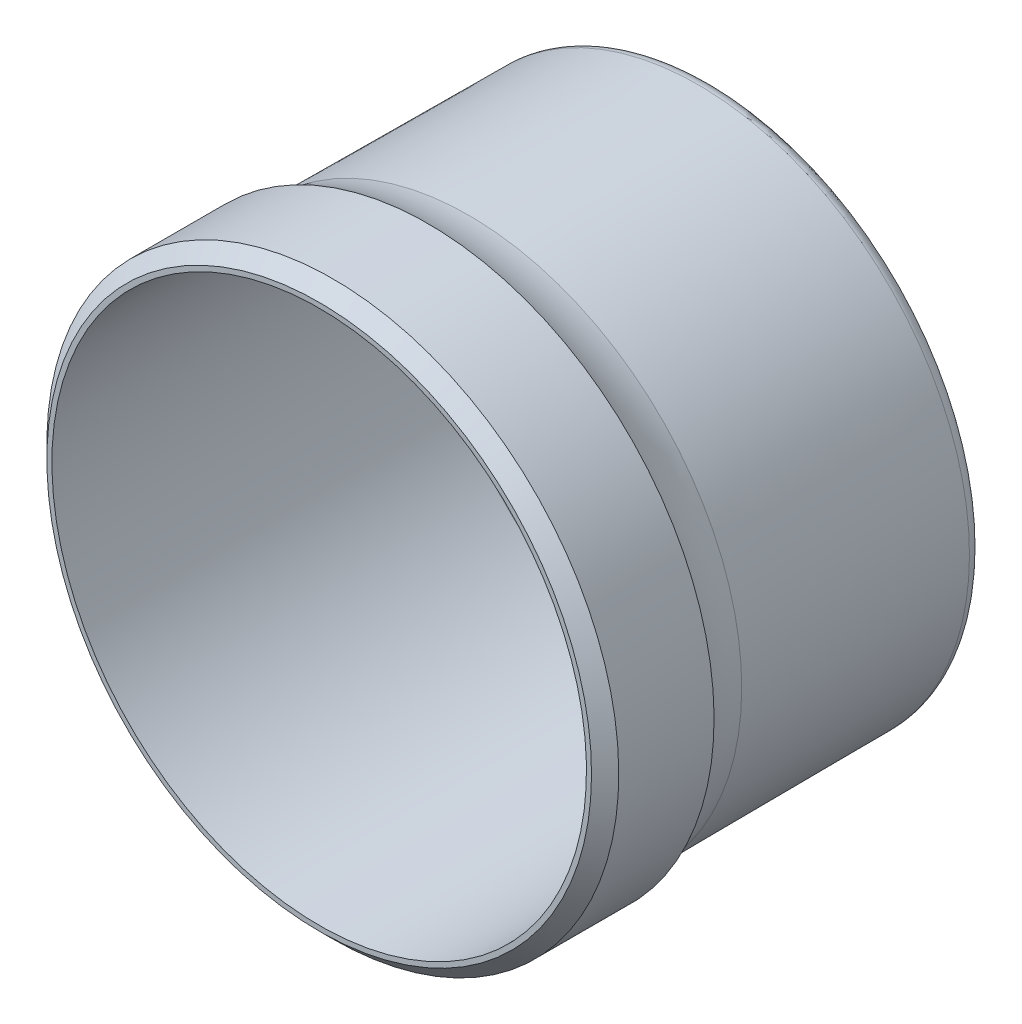
ISO-10303-21;
HEADER;
FILE_DESCRIPTION(('STEP AP214'),'2;1');
FILE_NAME('part.step','',(''),(''),'','','');
FILE_SCHEMA(('AUTOMOTIVE_DESIGN { 1 0 10303 214 1 1 1 1 }'));
ENDSEC;
DATA;
#1=APPLICATION_CONTEXT('core data for automotive mechanical design processes');
#2=APPLICATION_PROTOCOL_DEFINITION('international standard','automotive_design',2000,#1);
#3=PRODUCT_CONTEXT('',#1,'mechanical');
#4=PRODUCT('Part','Part','',(#3));
#5=PRODUCT_RELATED_PRODUCT_CATEGORY('part','',(#4));
#6=PRODUCT_DEFINITION_FORMATION('','',#4);
#7=PRODUCT_DEFINITION_CONTEXT('part definition',#1,'design');
#8=PRODUCT_DEFINITION('design','',#6,#7);
#9=PRODUCT_DEFINITION_SHAPE('','',#8);
#10=(LENGTH_UNIT() NAMED_UNIT(*) SI_UNIT(.MILLI.,.METRE.));
#11=(NAMED_UNIT(*) PLANE_ANGLE_UNIT() SI_UNIT($,.RADIAN.));
#12=(NAMED_UNIT(*) SI_UNIT($,.STERADIAN.) SOLID_ANGLE_UNIT());
#13=UNCERTAINTY_MEASURE_WITH_UNIT(LENGTH_MEASURE(1.E-05),#10,'distance_accuracy_value','');
#14=(GEOMETRIC_REPRESENTATION_CONTEXT(3) GLOBAL_UNCERTAINTY_ASSIGNED_CONTEXT((#13)) GLOBAL_UNIT_ASSIGNED_CONTEXT((#10,
#11,#12)) REPRESENTATION_CONTEXT('',''));
#15=CARTESIAN_POINT('',(0.,0.,0.));
#16=DIRECTION('',(0.,0.,1.));
#17=DIRECTION('',(1.,0.,0.));
#18=AXIS2_PLACEMENT_3D('',#15,#16,#17);
#19=CARTESIAN_POINT('',(0.,0.,6.50000000003789));
#20=DIRECTION('',(0.,0.,-1.));
#21=DIRECTION('',(0.793112373791637,0.609075334042182,0.));
#22=AXIS2_PLACEMENT_3D('',#19,#20,#21);
#23=CYLINDRICAL_SURFACE('',#22,9.815);
#24=CARTESIAN_POINT('',(0.,0.,-7.34999999996211));
#25=DIRECTION('',(0.,0.,-1.));
#26=DIRECTION('',(-0.793112373791637,-0.609075334042182,0.));
#27=AXIS2_PLACEMENT_3D('',#24,#25,#26);
#28=CIRCLE('',#27,9.815);
#29=CARTESIAN_POINT('',(-7.78439794876488,-5.97807440362398,-7.34999999996211));
#30=VERTEX_POINT('',#29);
#31=EDGE_CURVE('E11',#30,#30,#28,.T.);
#32=ORIENTED_EDGE('',*,*,#31,.T.);
#33=EDGE_LOOP('',(#32));
#34=FACE_BOUND('',#33,.T.);
#35=CARTESIAN_POINT('',(0.,0.,6.50000000003789));
#36=DIRECTION('',(0.,0.,-1.));
#37=DIRECTION('',(-0.793112373791637,-0.609075334042182,0.));
#38=AXIS2_PLACEMENT_3D('',#35,#36,#37);
#39=CIRCLE('',#38,9.815);
#40=CARTESIAN_POINT('',(-7.78439794876491,-5.97807440362401,6.50000000003789));
#41=VERTEX_POINT('',#40);
#42=EDGE_CURVE('E148',#41,#41,#39,.T.);
#43=ORIENTED_EDGE('',*,*,#42,.F.);
#44=EDGE_LOOP('',(#43));
#45=FACE_BOUND('',#44,.T.);
#46=ADVANCED_FACE('F17',(#34,#45),#23,.F.);
#47=CARTESIAN_POINT('',(0.,0.,-7.34999999996211));
#48=DIRECTION('',(0.,0.,-1.));
#49=DIRECTION('',(0.793112373791637,0.609075334042182,0.));
#50=AXIS2_PLACEMENT_3D('',#47,#48,#49);
#51=TOROIDAL_SURFACE('',#50,9.415,0.4);
#52=CARTESIAN_POINT('',(0.,0.,-7.74999999996211));
#53=DIRECTION('',(0.,0.,-1.));
#54=DIRECTION('',(-0.793112373791637,-0.609075334042182,0.));
#55=AXIS2_PLACEMENT_3D('',#52,#53,#54);
#56=CIRCLE('',#55,9.415);
#57=CARTESIAN_POINT('',(-7.46715299924822,-5.73444427000711,-7.74999999996211));
#58=VERTEX_POINT('',#57);
#59=EDGE_CURVE('E28',#58,#58,#56,.T.);
#60=ORIENTED_EDGE('',*,*,#59,.T.);
#61=EDGE_LOOP('',(#60));
#62=FACE_BOUND('',#61,.T.);
#63=ORIENTED_EDGE('',*,*,#31,.F.);
#64=EDGE_LOOP('',(#63));
#65=FACE_BOUND('',#64,.T.);
#66=ADVANCED_FACE('F236',(#62,#65),#51,.F.);
#67=CARTESIAN_POINT('',(-3.65250076357213,4.75613341891109,-7.74999999998101));
#68=DIRECTION('',(0.,0.,1.));
#69=DIRECTION('',(-0.793112373791637,-0.609075334042182,0.));
#70=AXIS2_PLACEMENT_3D('',#67,#68,#69);
#71=PLANE('',#70);
#72=CARTESIAN_POINT('',(-1.52927118695299,-3.69612359597936,-7.74999999998101));
#73=DIRECTION('',(0.,0.,-1.));
#74=DIRECTION('',(0.793112373791637,0.609075334042182,0.));
#75=AXIS2_PLACEMENT_3D('',#72,#73,#74);
#76=CIRCLE('',#75,1.75);
#77=CARTESIAN_POINT('',(-0.14132453281763,-2.63024176140554,-7.74999999998101));
#78=VERTEX_POINT('',#77);
#79=EDGE_CURVE('E222',#78,#78,#76,.T.);
#80=ORIENTED_EDGE('',*,*,#79,.T.);
#81=EDGE_LOOP('',(#80));
#82=FACE_BOUND('',#81,.T.);
#83=CARTESIAN_POINT('',(-2.43630133616872,3.17244949516655,-7.74999999998101));
#84=DIRECTION('',(0.,0.,-1.));
#85=DIRECTION('',(0.793112373791637,0.609075334042182,0.));
#86=AXIS2_PLACEMENT_3D('',#83,#84,#85);
#87=CIRCLE('',#86,1.75);
#88=CARTESIAN_POINT('',(-1.04835468203336,4.23833132974037,-7.74999999998101));
#89=VERTEX_POINT('',#88);
#90=EDGE_CURVE('E218',#89,#89,#87,.T.);
#91=ORIENTED_EDGE('',*,*,#90,.T.);
#92=EDGE_LOOP('',(#91));
#93=FACE_BOUND('',#92,.T.);
#94=CARTESIAN_POINT('',(3.96557252312171,0.523674100812805,-7.74999999998101));
#95=DIRECTION('',(0.,0.,-1.));
#96=DIRECTION('',(0.793112373791637,0.609075334042182,0.));
#97=AXIS2_PLACEMENT_3D('',#94,#95,#96);
#98=CIRCLE('',#97,1.75);
#99=CARTESIAN_POINT('',(5.35351917725708,1.58955593538663,-7.74999999998101));
#100=VERTEX_POINT('',#99);
#101=EDGE_CURVE('E214',#100,#100,#98,.T.);
#102=ORIENTED_EDGE('',*,*,#101,.T.);
#103=EDGE_LOOP('',(#102));
#104=FACE_BOUND('',#103,.T.);
#105=CARTESIAN_POINT('',(0.,0.,-7.74999999998101));
#106=DIRECTION('',(0.,0.,-1.));
#107=DIRECTION('',(0.793112373791637,0.609075334042182,0.));
#108=AXIS2_PLACEMENT_3D('',#105,#106,#107);
#109=CIRCLE('',#108,2.1);
#110=CARTESIAN_POINT('',(1.66553598496244,1.27905820148858,-7.74999999998101));
#111=VERTEX_POINT('',#110);
#112=EDGE_CURVE('E210',#111,#111,#109,.T.);
#113=ORIENTED_EDGE('',*,*,#112,.T.);
#114=EDGE_LOOP('',(#113));
#115=FACE_BOUND('',#114,.T.);
#116=ORIENTED_EDGE('',*,*,#59,.F.);
#117=EDGE_LOOP('',(#116));
#118=FACE_BOUND('',#117,.T.);
#119=ADVANCED_FACE('F242',(#82,#93,#104,#115,#118),#71,.T.);
#120=CARTESIAN_POINT('',(0.,0.,6.50000000003789));
#121=DIRECTION('',(0.,0.,-1.));
#122=DIRECTION('',(0.793112373791637,0.609075334042182,0.));
#123=AXIS2_PLACEMENT_3D('',#120,#121,#122);
#124=CYLINDRICAL_SURFACE('',#123,2.);
#125=CARTESIAN_POINT('',(0.,0.,-10.4));
#126=DIRECTION('',(0.,0.,-1.));
#127=DIRECTION('',(-0.793112373791637,-0.609075334042182,0.));
#128=AXIS2_PLACEMENT_3D('',#125,#126,#127);
#129=CIRCLE('',#128,2.);
#130=CARTESIAN_POINT('',(-1.58622474758327,-1.21815066808436,-10.4));
#131=VERTEX_POINT('',#130);
#132=EDGE_CURVE('E206',#131,#131,#129,.T.);
#133=ORIENTED_EDGE('',*,*,#132,.T.);
#134=EDGE_LOOP('',(#133));
#135=FACE_BOUND('',#134,.T.);
#136=CARTESIAN_POINT('',(0.,0.,-7.84999999998101));
#137=DIRECTION('',(0.,0.,1.));
#138=DIRECTION('',(0.793112373791637,0.609075334042182,0.));
#139=AXIS2_PLACEMENT_3D('',#136,#137,#138);
#140=CIRCLE('',#139,2.);
#141=CARTESIAN_POINT('',(1.58622474758327,1.21815066808436,-7.84999999998101));
#142=VERTEX_POINT('',#141);
#143=EDGE_CURVE('E202',#142,#142,#140,.T.);
#144=ORIENTED_EDGE('',*,*,#143,.T.);
#145=EDGE_LOOP('',(#144));
#146=FACE_BOUND('',#145,.T.);
#147=ADVANCED_FACE('F248',(#135,#146),#124,.F.);
#148=CARTESIAN_POINT('',(-2.43630133534537,3.1724494940944,-10.5));
#149=DIRECTION('',(0.,0.,-1.));
#150=DIRECTION('',(0.793112373791637,0.609075334042182,0.));
#151=AXIS2_PLACEMENT_3D('',#148,#149,#150);
#152=PLANE('',#151);
#153=CARTESIAN_POINT('',(-1.52927118695299,-3.69612359597936,-10.5));
#154=DIRECTION('',(0.,0.,1.));
#155=DIRECTION('',(-0.793112373791637,-0.609075334042182,0.));
#156=AXIS2_PLACEMENT_3D('',#153,#154,#155);
#157=CIRCLE('',#156,1.75);
#158=CARTESIAN_POINT('',(-2.91721784108836,-4.76200543055318,-10.5));
#159=VERTEX_POINT('',#158);
#160=EDGE_CURVE('E198',#159,#159,#157,.T.);
#161=ORIENTED_EDGE('',*,*,#160,.T.);
#162=EDGE_LOOP('',(#161));
#163=FACE_BOUND('',#162,.T.);
#164=CARTESIAN_POINT('',(0.,0.,-10.5));
#165=DIRECTION('',(0.,0.,1.));
#166=DIRECTION('',(-0.793112373791637,-0.609075334042182,0.));
#167=AXIS2_PLACEMENT_3D('',#164,#165,#166);
#168=CIRCLE('',#167,2.1);
#169=CARTESIAN_POINT('',(-1.66553598496244,-1.27905820148858,-10.5));
#170=VERTEX_POINT('',#169);
#171=EDGE_CURVE('E194',#170,#170,#168,.T.);
#172=ORIENTED_EDGE('',*,*,#171,.T.);
#173=EDGE_LOOP('',(#172));
#174=FACE_BOUND('',#173,.T.);
#175=CARTESIAN_POINT('',(-2.43630133616872,3.17244949516655,-10.5));
#176=DIRECTION('',(0.,0.,1.));
#177=DIRECTION('',(-0.793112373791637,-0.609075334042182,0.));
#178=AXIS2_PLACEMENT_3D('',#175,#176,#177);
#179=CIRCLE('',#178,1.75);
#180=CARTESIAN_POINT('',(-3.82424799030409,2.10656766059273,-10.5));
#181=VERTEX_POINT('',#180);
#182=EDGE_CURVE('E190',#181,#181,#179,.T.);
#183=ORIENTED_EDGE('',*,*,#182,.T.);
#184=EDGE_LOOP('',(#183));
#185=FACE_BOUND('',#184,.T.);
#186=CARTESIAN_POINT('',(3.96557252312171,0.523674100812805,-10.5));
#187=DIRECTION('',(0.,0.,1.));
#188=DIRECTION('',(-0.793112373791637,-0.609075334042182,0.));
#189=AXIS2_PLACEMENT_3D('',#186,#187,#188);
#190=CIRCLE('',#189,1.75);
#191=CARTESIAN_POINT('',(2.57762586898635,-0.542207733761013,-10.5));
#192=VERTEX_POINT('',#191);
#193=EDGE_CURVE('E186',#192,#192,#190,.T.);
#194=ORIENTED_EDGE('',*,*,#193,.T.);
#195=EDGE_LOOP('',(#194));
#196=FACE_BOUND('',#195,.T.);
#197=CARTESIAN_POINT('',(0.,0.,-10.5));
#198=DIRECTION('',(0.,0.,-1.));
#199=DIRECTION('',(-0.793112373791637,-0.609075334042182,0.));
#200=AXIS2_PLACEMENT_3D('',#197,#198,#199);
#201=CIRCLE('',#200,5.79999999864818);
#202=CARTESIAN_POINT('',(-4.60005176691935,-3.5326369366213,-10.5));
#203=VERTEX_POINT('',#202);
#204=EDGE_CURVE('E182',#203,#203,#201,.T.);
#205=ORIENTED_EDGE('',*,*,#204,.T.);
#206=EDGE_LOOP('',(#205));
#207=FACE_BOUND('',#206,.T.);
#208=ADVANCED_FACE('F252',(#163,#174,#185,#196,#207),#152,.T.);
#209=CARTESIAN_POINT('',(0.,0.,6.50000000003789));
#210=DIRECTION('',(0.,0.,-1.));
#211=DIRECTION('',(0.793112373791637,0.609075334042182,0.));
#212=AXIS2_PLACEMENT_3D('',#209,#210,#211);
#213=CYLINDRICAL_SURFACE('',#212,5.99999999864818);
#214=CARTESIAN_POINT('',(0.,0.,-10.3));
#215=DIRECTION('',(0.,0.,1.));
#216=DIRECTION('',(-0.793112373791637,-0.609075334042182,0.));
#217=AXIS2_PLACEMENT_3D('',#214,#215,#216);
#218=CIRCLE('',#217,5.99999999864818);
#219=CARTESIAN_POINT('',(-4.75867424167768,-3.65445200342973,-10.3));
#220=VERTEX_POINT('',#219);
#221=EDGE_CURVE('E178',#220,#220,#218,.T.);
#222=ORIENTED_EDGE('',*,*,#221,.T.);
#223=EDGE_LOOP('',(#222));
#224=FACE_BOUND('',#223,.T.);
#225=CARTESIAN_POINT('',(0.,0.,-8.2));
#226=DIRECTION('',(0.,0.,-1.));
#227=DIRECTION('',(-0.793112373791637,-0.609075334042182,0.));
#228=AXIS2_PLACEMENT_3D('',#225,#226,#227);
#229=CIRCLE('',#228,5.99999999864818);
#230=CARTESIAN_POINT('',(-4.75867424167768,-3.65445200342973,-8.2));
#231=VERTEX_POINT('',#230);
#232=EDGE_CURVE('E174',#231,#231,#229,.T.);
#233=ORIENTED_EDGE('',*,*,#232,.T.);
#234=EDGE_LOOP('',(#233));
#235=FACE_BOUND('',#234,.T.);
#236=ADVANCED_FACE('F256',(#224,#235),#213,.T.);
#237=CARTESIAN_POINT('',(0.,0.,-8.2));
#238=DIRECTION('',(0.,0.,-1.));
#239=DIRECTION('',(0.793112373791637,0.609075334042182,0.));
#240=AXIS2_PLACEMENT_3D('',#237,#238,#239);
#241=TOROIDAL_SURFACE('',#240,6.19999999864818,0.2);
#242=CARTESIAN_POINT('',(0.,0.,-8.00007848836941));
#243=DIRECTION('',(0.,0.,-1.));
#244=DIRECTION('',(-0.793112373791637,-0.609075334042182,0.));
#245=AXIS2_PLACEMENT_3D('',#242,#243,#244);
#246=CIRCLE('',#245,6.19439739324077);
#247=CARTESIAN_POINT('',(-4.91285322076191,-3.77285466147814,-8.00007848836941));
#248=VERTEX_POINT('',#247);
#249=EDGE_CURVE('E171',#248,#248,#246,.T.);
#250=ORIENTED_EDGE('',*,*,#249,.T.);
#251=EDGE_LOOP('',(#250));
#252=FACE_BOUND('',#251,.T.);
#253=ORIENTED_EDGE('',*,*,#232,.F.);
#254=EDGE_LOOP('',(#253));
#255=FACE_BOUND('',#254,.T.);
#256=ADVANCED_FACE('F260',(#252,#255),#241,.F.);
#257=CARTESIAN_POINT('',(0.,0.,-8.00007848836941));
#258=DIRECTION('',(0.,0.,1.));
#259=DIRECTION('',(-0.793112373791637,-0.609075334042182,0.));
#260=AXIS2_PLACEMENT_3D('',#257,#258,#259);
#261=CONICAL_SURFACE('',#260,6.19439739324077,1.54277963468781);
#262=CARTESIAN_POINT('',(0.,0.,-7.90796835603491));
#263=DIRECTION('',(0.,0.,-1.));
#264=DIRECTION('',(-0.793112373791637,-0.609075334042182,0.));
#265=AXIS2_PLACEMENT_3D('',#262,#263,#264);
#266=CIRCLE('',#265,9.48122478044985);
#267=CARTESIAN_POINT('',(-7.51967669207467,-5.7747801502815,-7.90796835603491));
#268=VERTEX_POINT('',#267);
#269=EDGE_CURVE('E168',#268,#268,#266,.T.);
#270=ORIENTED_EDGE('',*,*,#269,.T.);
#271=EDGE_LOOP('',(#270));
#272=FACE_BOUND('',#271,.T.);
#273=ORIENTED_EDGE('',*,*,#249,.F.);
#274=EDGE_LOOP('',(#273));
#275=FACE_BOUND('',#274,.T.);
#276=ADVANCED_FACE('F264',(#272,#275),#261,.T.);
#277=CARTESIAN_POINT('',(0.,0.,-7.40816457695851));
#278=DIRECTION('',(0.,0.,-1.));
#279=DIRECTION('',(0.793112373791637,0.609075334042182,0.));
#280=AXIS2_PLACEMENT_3D('',#277,#278,#279);
#281=TOROIDAL_SURFACE('',#280,9.46721826693133,0.5);
#282=CARTESIAN_POINT('',(0.,0.,-7.41100544019391));
#283=DIRECTION('',(0.,0.,-1.));
#284=DIRECTION('',(-0.793112373791637,-0.609075334042182,0.));
#285=AXIS2_PLACEMENT_3D('',#282,#283,#284);
#286=CIRCLE('',#285,9.96721019636227);
#287=CARTESIAN_POINT('',(-7.90511773891709,-6.07078187981799,-7.41100544019391));
#288=VERTEX_POINT('',#287);
#289=EDGE_CURVE('E165',#288,#288,#286,.T.);
#290=ORIENTED_EDGE('',*,*,#289,.T.);
#291=EDGE_LOOP('',(#290));
#292=FACE_BOUND('',#291,.T.);
#293=ORIENTED_EDGE('',*,*,#269,.F.);
#294=EDGE_LOOP('',(#293));
#295=FACE_BOUND('',#294,.T.);
#296=ADVANCED_FACE('F268',(#292,#295),#281,.T.);
#297=CARTESIAN_POINT('',(0.,0.,-7.41100544019391));
#298=DIRECTION('',(0.,0.,1.));
#299=DIRECTION('',(-0.793112373791637,-0.609075334042182,0.));
#300=AXIS2_PLACEMENT_3D('',#297,#298,#299);
#301=CONICAL_SURFACE('',#300,9.96721019636227,0.0056817570408517);
#302=CARTESIAN_POINT('',(0.,0.,1.0000000000379));
#303=DIRECTION('',(0.,0.,-1.));
#304=DIRECTION('',(-0.793112373791637,-0.609075334042182,0.));
#305=AXIS2_PLACEMENT_3D('',#302,#303,#304);
#306=CIRCLE('',#305,10.015);
#307=CARTESIAN_POINT('',(-7.94302042352324,-6.09988947043245,1.0000000000379));
#308=VERTEX_POINT('',#307);
#309=EDGE_CURVE('E161',#308,#308,#306,.T.);
#310=ORIENTED_EDGE('',*,*,#309,.T.);
#311=EDGE_LOOP('',(#310));
#312=FACE_BOUND('',#311,.T.);
#313=ORIENTED_EDGE('',*,*,#289,.F.);
#314=EDGE_LOOP('',(#313));
#315=FACE_BOUND('',#314,.T.);
#316=ADVANCED_FACE('F272',(#312,#315),#301,.T.);
#317=CARTESIAN_POINT('',(0.,0.,0.543524225242989));
#318=DIRECTION('',(0.,0.,-1.));
#319=DIRECTION('',(0.793112373791637,0.609075334042182,0.));
#320=AXIS2_PLACEMENT_3D('',#317,#318,#319);
#321=TOROIDAL_SURFACE('',#320,13.9888683756543,4.);
#322=CARTESIAN_POINT('',(0.,0.,2.50000000003789));
#323=DIRECTION('',(0.,0.,-1.));
#324=DIRECTION('',(-0.793112373791637,-0.609075334042182,0.));
#325=AXIS2_PLACEMENT_3D('',#322,#323,#324);
#326=CIRCLE('',#325,10.5);
#327=CARTESIAN_POINT('',(-8.32767992481219,-6.39529100744291,2.50000000003789));
#328=VERTEX_POINT('',#327);
#329=EDGE_CURVE('E157',#328,#328,#326,.T.);
#330=ORIENTED_EDGE('',*,*,#329,.T.);
#331=EDGE_LOOP('',(#330));
#332=FACE_BOUND('',#331,.T.);
#333=ORIENTED_EDGE('',*,*,#309,.F.);
#334=EDGE_LOOP('',(#333));
#335=FACE_BOUND('',#334,.T.);
#336=ADVANCED_FACE('F276',(#332,#335),#321,.F.);
#337=CARTESIAN_POINT('',(0.,0.,6.50000000003789));
#338=DIRECTION('',(0.,0.,-1.));
#339=DIRECTION('',(0.793112373791637,0.609075334042182,0.));
#340=AXIS2_PLACEMENT_3D('',#337,#338,#339);
#341=CYLINDRICAL_SURFACE('',#340,10.5);
#342=CARTESIAN_POINT('',(0.,0.,6.00000000003789));
#343=DIRECTION('',(0.,0.,-1.));
#344=DIRECTION('',(-0.793112373791637,-0.609075334042182,0.));
#345=AXIS2_PLACEMENT_3D('',#342,#343,#344);
#346=CIRCLE('',#345,10.5);
#347=CARTESIAN_POINT('',(-8.32767992481219,-6.39529100744291,6.00000000003789));
#348=VERTEX_POINT('',#347);
#349=EDGE_CURVE('E153',#348,#348,#346,.T.);
#350=ORIENTED_EDGE('',*,*,#349,.T.);
#351=EDGE_LOOP('',(#350));
#352=FACE_BOUND('',#351,.T.);
#353=ORIENTED_EDGE('',*,*,#329,.F.);
#354=EDGE_LOOP('',(#353));
#355=FACE_BOUND('',#354,.T.);
#356=ADVANCED_FACE('F280',(#352,#355),#341,.T.);
#357=CARTESIAN_POINT('',(0.,0.,6.00000000003789));
#358=DIRECTION('',(0.,0.,-1.));
#359=DIRECTION('',(0.793112373791637,0.609075334042182,0.));
#360=AXIS2_PLACEMENT_3D('',#357,#358,#359);
#361=CONICAL_SURFACE('',#360,10.5,0.785398163397446);
#362=CARTESIAN_POINT('',(0.,0.,6.50000000003789));
#363=DIRECTION('',(0.,0.,-1.));
#364=DIRECTION('',(-0.793112373791637,-0.609075334042182,0.));
#365=AXIS2_PLACEMENT_3D('',#362,#363,#364);
#366=CIRCLE('',#365,10.);
#367=CARTESIAN_POINT('',(-7.93112373791637,-6.09075334042182,6.50000000003789));
#368=VERTEX_POINT('',#367);
#369=EDGE_CURVE('E149',#368,#368,#366,.T.);
#370=ORIENTED_EDGE('',*,*,#369,.T.);
#371=EDGE_LOOP('',(#370));
#372=FACE_BOUND('',#371,.T.);
#373=ORIENTED_EDGE('',*,*,#349,.F.);
#374=EDGE_LOOP('',(#373));
#375=FACE_BOUND('',#374,.T.);
#376=ADVANCED_FACE('F284',(#372,#375),#361,.T.);
#377=CARTESIAN_POINT('',(-6.09075334042182,7.93112373791637,6.50000000003789));
#378=DIRECTION('',(0.,0.,1.));
#379=DIRECTION('',(-0.793112373791637,-0.609075334042182,0.));
#380=AXIS2_PLACEMENT_3D('',#377,#378,#379);
#381=PLANE('',#380);
#382=ORIENTED_EDGE('',*,*,#42,.T.);
#383=EDGE_LOOP('',(#382));
#384=FACE_BOUND('',#383,.T.);
#385=ORIENTED_EDGE('',*,*,#369,.F.);
#386=EDGE_LOOP('',(#385));
#387=FACE_BOUND('',#386,.T.);
#388=ADVANCED_FACE('F232',(#384,#387),#381,.T.);
#389=CARTESIAN_POINT('',(-2.43630133616872,3.17244949516655,-10.5));
#390=DIRECTION('',(0.,0.,1.));
#391=DIRECTION('',(-0.793112373791637,-0.609075334042182,0.));
#392=AXIS2_PLACEMENT_3D('',#389,#390,#391);
#393=CYLINDRICAL_SURFACE('',#392,1.65);
#394=CARTESIAN_POINT('',(-2.43630133616872,3.17244949516655,-7.84999999998101));
#395=DIRECTION('',(0.,0.,1.));
#396=DIRECTION('',(0.793112373791637,0.609075334042182,0.));
#397=AXIS2_PLACEMENT_3D('',#394,#395,#396);
#398=CIRCLE('',#397,1.65);
#399=CARTESIAN_POINT('',(-1.12766591941253,4.17742379633614,-7.84999999998101));
#400=VERTEX_POINT('',#399);
#401=EDGE_CURVE('E144',#400,#400,#398,.T.);
#402=ORIENTED_EDGE('',*,*,#401,.T.);
#403=EDGE_LOOP('',(#402));
#404=FACE_BOUND('',#403,.T.);
#405=CARTESIAN_POINT('',(-2.43630133616872,3.17244949516655,-10.4));
#406=DIRECTION('',(0.,0.,-1.));
#407=DIRECTION('',(-0.793112373791637,-0.609075334042182,0.));
#408=AXIS2_PLACEMENT_3D('',#405,#406,#407);
#409=CIRCLE('',#408,1.65);
#410=CARTESIAN_POINT('',(-3.74493675292493,2.16747519399695,-10.4));
#411=VERTEX_POINT('',#410);
#412=EDGE_CURVE('E140',#411,#411,#409,.T.);
#413=ORIENTED_EDGE('',*,*,#412,.T.);
#414=EDGE_LOOP('',(#413));
#415=FACE_BOUND('',#414,.T.);
#416=ADVANCED_FACE('F291',(#404,#415),#393,.F.);
#417=CARTESIAN_POINT('',(-1.52927118695299,-3.69612359597936,-10.5));
#418=DIRECTION('',(0.,0.,1.));
#419=DIRECTION('',(-0.793112373791637,-0.609075334042182,0.));
#420=AXIS2_PLACEMENT_3D('',#417,#418,#419);
#421=CYLINDRICAL_SURFACE('',#420,1.65);
#422=CARTESIAN_POINT('',(-1.52927118695299,-3.69612359597936,-7.84999999998101));
#423=DIRECTION('',(0.,0.,1.));
#424=DIRECTION('',(0.793112373791637,0.609075334042182,0.));
#425=AXIS2_PLACEMENT_3D('',#422,#423,#424);
#426=CIRCLE('',#425,1.65);
#427=CARTESIAN_POINT('',(-0.220635770196794,-2.69114929480976,-7.84999999998101));
#428=VERTEX_POINT('',#427);
#429=EDGE_CURVE('E134',#428,#428,#426,.T.);
#430=ORIENTED_EDGE('',*,*,#429,.T.);
#431=EDGE_LOOP('',(#430));
#432=FACE_BOUND('',#431,.T.);
#433=CARTESIAN_POINT('',(-1.52927118695299,-3.69612359597936,-10.4));
#434=DIRECTION('',(0.,0.,-1.));
#435=DIRECTION('',(-0.793112373791637,-0.609075334042182,0.));
#436=AXIS2_PLACEMENT_3D('',#433,#434,#435);
#437=CIRCLE('',#436,1.65);
#438=CARTESIAN_POINT('',(-2.83790660370919,-4.70109789714896,-10.4));
#439=VERTEX_POINT('',#438);
#440=EDGE_CURVE('E127',#439,#439,#437,.T.);
#441=ORIENTED_EDGE('',*,*,#440,.T.);
#442=EDGE_LOOP('',(#441));
#443=FACE_BOUND('',#442,.T.);
#444=ADVANCED_FACE('F294',(#432,#443),#421,.F.);
#445=CARTESIAN_POINT('',(3.96557252312171,0.523674100812805,-10.5));
#446=DIRECTION('',(0.,0.,1.));
#447=DIRECTION('',(-0.793112373791637,-0.609075334042182,0.));
#448=AXIS2_PLACEMENT_3D('',#445,#446,#447);
#449=CYLINDRICAL_SURFACE('',#448,1.65);
#450=CARTESIAN_POINT('',(3.96557252312171,0.523674100812805,-7.84999999998101));
#451=DIRECTION('',(0.,0.,1.));
#452=DIRECTION('',(0.793112373791637,0.609075334042182,0.));
#453=AXIS2_PLACEMENT_3D('',#450,#451,#452);
#454=CIRCLE('',#453,1.65);
#455=CARTESIAN_POINT('',(5.27420793987792,1.5286484019824,-7.84999999998101));
#456=VERTEX_POINT('',#455);
#457=EDGE_CURVE('E115',#456,#456,#454,.T.);
#458=ORIENTED_EDGE('',*,*,#457,.T.);
#459=EDGE_LOOP('',(#458));
#460=FACE_BOUND('',#459,.T.);
#461=CARTESIAN_POINT('',(3.96557252312171,0.523674100812805,-10.4));
#462=DIRECTION('',(0.,0.,-1.));
#463=DIRECTION('',(-0.793112373791637,-0.609075334042182,0.));
#464=AXIS2_PLACEMENT_3D('',#461,#462,#463);
#465=CIRCLE('',#464,1.65);
#466=CARTESIAN_POINT('',(2.65693710636551,-0.481300200356795,-10.4));
#467=VERTEX_POINT('',#466);
#468=EDGE_CURVE('E21',#467,#467,#465,.T.);
#469=ORIENTED_EDGE('',*,*,#468,.T.);
#470=EDGE_LOOP('',(#469));
#471=FACE_BOUND('',#470,.T.);
#472=ADVANCED_FACE('F298',(#460,#471),#449,.F.);
#473=CARTESIAN_POINT('',(0.,0.,-10.5));
#474=DIRECTION('',(0.,0.,1.));
#475=DIRECTION('',(-0.793112373791637,-0.609075334042182,0.));
#476=AXIS2_PLACEMENT_3D('',#473,#474,#475);
#477=CONICAL_SURFACE('',#476,5.79999999864818,0.78539816339745);
#478=ORIENTED_EDGE('',*,*,#221,.F.);
#479=EDGE_LOOP('',(#478));
#480=FACE_BOUND('',#479,.T.);
#481=ORIENTED_EDGE('',*,*,#204,.F.);
#482=EDGE_LOOP('',(#481));
#483=FACE_BOUND('',#482,.T.);
#484=ADVANCED_FACE('F302',(#480,#483),#477,.T.);
#485=CARTESIAN_POINT('',(-1.52927118695299,-3.69612359597936,-7.84999999998101));
#486=DIRECTION('',(0.,0.,1.));
#487=DIRECTION('',(-0.793112373791637,-0.609075334042182,0.));
#488=AXIS2_PLACEMENT_3D('',#485,#486,#487);
#489=CONICAL_SURFACE('',#488,1.65,0.785398163397452);
#490=ORIENTED_EDGE('',*,*,#79,.F.);
#491=EDGE_LOOP('',(#490));
#492=FACE_BOUND('',#491,.T.);
#493=ORIENTED_EDGE('',*,*,#429,.F.);
#494=EDGE_LOOP('',(#493));
#495=FACE_BOUND('',#494,.T.);
#496=ADVANCED_FACE('F305',(#492,#495),#489,.F.);
#497=CARTESIAN_POINT('',(-2.43630133616872,3.17244949516655,-7.84999999998101));
#498=DIRECTION('',(0.,0.,1.));
#499=DIRECTION('',(-0.793112373791637,-0.609075334042182,0.));
#500=AXIS2_PLACEMENT_3D('',#497,#498,#499);
#501=CONICAL_SURFACE('',#500,1.65,0.785398163397452);
#502=ORIENTED_EDGE('',*,*,#90,.F.);
#503=EDGE_LOOP('',(#502));
#504=FACE_BOUND('',#503,.T.);
#505=ORIENTED_EDGE('',*,*,#401,.F.);
#506=EDGE_LOOP('',(#505));
#507=FACE_BOUND('',#506,.T.);
#508=ADVANCED_FACE('F309',(#504,#507),#501,.F.);
#509=CARTESIAN_POINT('',(3.96557252312171,0.523674100812805,-7.84999999998101));
#510=DIRECTION('',(0.,0.,1.));
#511=DIRECTION('',(-0.793112373791637,-0.609075334042182,0.));
#512=AXIS2_PLACEMENT_3D('',#509,#510,#511);
#513=CONICAL_SURFACE('',#512,1.65,0.785398163397452);
#514=ORIENTED_EDGE('',*,*,#101,.F.);
#515=EDGE_LOOP('',(#514));
#516=FACE_BOUND('',#515,.T.);
#517=ORIENTED_EDGE('',*,*,#457,.F.);
#518=EDGE_LOOP('',(#517));
#519=FACE_BOUND('',#518,.T.);
#520=ADVANCED_FACE('F313',(#516,#519),#513,.F.);
#521=CARTESIAN_POINT('',(-1.52927118695299,-3.69612359597936,-10.5));
#522=DIRECTION('',(0.,0.,-1.));
#523=DIRECTION('',(0.793112373791637,0.609075334042182,0.));
#524=AXIS2_PLACEMENT_3D('',#521,#522,#523);
#525=CONICAL_SURFACE('',#524,1.75,0.785398163397452);
#526=ORIENTED_EDGE('',*,*,#440,.F.);
#527=EDGE_LOOP('',(#526));
#528=FACE_BOUND('',#527,.T.);
#529=ORIENTED_EDGE('',*,*,#160,.F.);
#530=EDGE_LOOP('',(#529));
#531=FACE_BOUND('',#530,.T.);
#532=ADVANCED_FACE('F317',(#528,#531),#525,.F.);
#533=CARTESIAN_POINT('',(0.,0.,-10.4));
#534=DIRECTION('',(0.,0.,-1.));
#535=DIRECTION('',(0.793112373791637,0.609075334042182,0.));
#536=AXIS2_PLACEMENT_3D('',#533,#534,#535);
#537=CONICAL_SURFACE('',#536,2.,0.78539816339745);
#538=ORIENTED_EDGE('',*,*,#171,.F.);
#539=EDGE_LOOP('',(#538));
#540=FACE_BOUND('',#539,.T.);
#541=ORIENTED_EDGE('',*,*,#132,.F.);
#542=EDGE_LOOP('',(#541));
#543=FACE_BOUND('',#542,.T.);
#544=ADVANCED_FACE('F321',(#540,#543),#537,.F.);
#545=CARTESIAN_POINT('',(0.,0.,-7.74999999998101));
#546=DIRECTION('',(0.,0.,1.));
#547=DIRECTION('',(-0.793112373791637,-0.609075334042182,0.));
#548=AXIS2_PLACEMENT_3D('',#545,#546,#547);
#549=CONICAL_SURFACE('',#548,2.1,0.78539816339745);
#550=ORIENTED_EDGE('',*,*,#143,.F.);
#551=EDGE_LOOP('',(#550));
#552=FACE_BOUND('',#551,.T.);
#553=ORIENTED_EDGE('',*,*,#112,.F.);
#554=EDGE_LOOP('',(#553));
#555=FACE_BOUND('',#554,.T.);
#556=ADVANCED_FACE('F325',(#552,#555),#549,.F.);
#557=CARTESIAN_POINT('',(-2.43630133616872,3.17244949516655,-10.5));
#558=DIRECTION('',(0.,0.,-1.));
#559=DIRECTION('',(0.793112373791637,0.609075334042182,0.));
#560=AXIS2_PLACEMENT_3D('',#557,#558,#559);
#561=CONICAL_SURFACE('',#560,1.75,0.785398163397452);
#562=ORIENTED_EDGE('',*,*,#412,.F.);
#563=EDGE_LOOP('',(#562));
#564=FACE_BOUND('',#563,.T.);
#565=ORIENTED_EDGE('',*,*,#182,.F.);
#566=EDGE_LOOP('',(#565));
#567=FACE_BOUND('',#566,.T.);
#568=ADVANCED_FACE('F328',(#564,#567),#561,.F.);
#569=CARTESIAN_POINT('',(3.96557252312171,0.523674100812805,-10.5));
#570=DIRECTION('',(0.,0.,-1.));
#571=DIRECTION('',(0.793112373791637,0.609075334042182,0.));
#572=AXIS2_PLACEMENT_3D('',#569,#570,#571);
#573=CONICAL_SURFACE('',#572,1.75,0.785398163397452);
#574=ORIENTED_EDGE('',*,*,#468,.F.);
#575=EDGE_LOOP('',(#574));
#576=FACE_BOUND('',#575,.T.);
#577=ORIENTED_EDGE('',*,*,#193,.F.);
#578=EDGE_LOOP('',(#577));
#579=FACE_BOUND('',#578,.T.);
#580=ADVANCED_FACE('F19',(#576,#579),#573,.F.);
#581=CLOSED_SHELL('',(#46,#66,#119,#147,#208,#236,#256,#276,#296,#316,#336,#356,#376,#388,#416,
#444,#472,#484,#496,#508,#520,#532,#544,#556,#568,#580));
#582=MANIFOLD_SOLID_BREP('B1',#581);
#583=ADVANCED_BREP_SHAPE_REPRESENTATION('',(#18,#582),#14);
#584=SHAPE_DEFINITION_REPRESENTATION(#9,#583);
ENDSEC;
END-ISO-10303-21;
